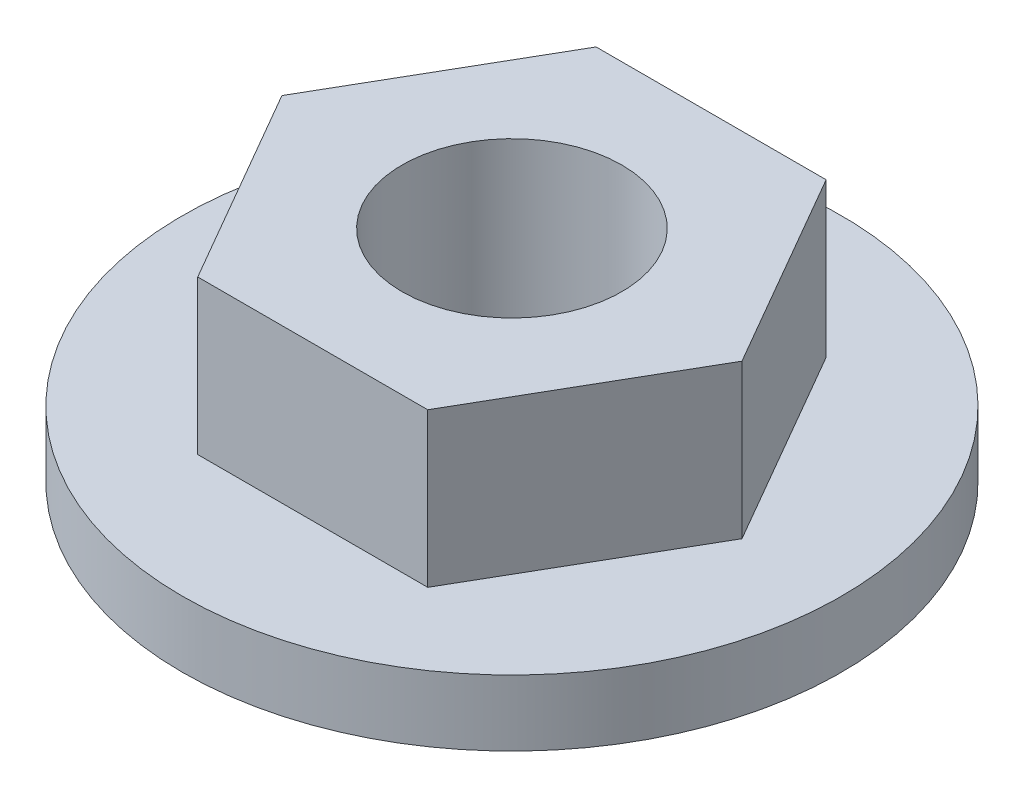
ISO-10303-21;
HEADER;
FILE_DESCRIPTION(('STEP AP214'),'2;1');
FILE_NAME('part.step','',(''),(''),'','','');
FILE_SCHEMA(('AUTOMOTIVE_DESIGN { 1 0 10303 214 1 1 1 1 }'));
ENDSEC;
DATA;
#1=APPLICATION_CONTEXT('core data for automotive mechanical design processes');
#2=APPLICATION_PROTOCOL_DEFINITION('international standard','automotive_design',2000,#1);
#3=PRODUCT_CONTEXT('',#1,'mechanical');
#4=PRODUCT('Part','Part','',(#3));
#5=PRODUCT_RELATED_PRODUCT_CATEGORY('part','',(#4));
#6=PRODUCT_DEFINITION_FORMATION('','',#4);
#7=PRODUCT_DEFINITION_CONTEXT('part definition',#1,'design');
#8=PRODUCT_DEFINITION('design','',#6,#7);
#9=PRODUCT_DEFINITION_SHAPE('','',#8);
#10=(LENGTH_UNIT() NAMED_UNIT(*) SI_UNIT(.MILLI.,.METRE.));
#11=(NAMED_UNIT(*) PLANE_ANGLE_UNIT() SI_UNIT($,.RADIAN.));
#12=(NAMED_UNIT(*) SI_UNIT($,.STERADIAN.) SOLID_ANGLE_UNIT());
#13=UNCERTAINTY_MEASURE_WITH_UNIT(LENGTH_MEASURE(1.E-05),#10,'distance_accuracy_value','');
#14=(GEOMETRIC_REPRESENTATION_CONTEXT(3) GLOBAL_UNCERTAINTY_ASSIGNED_CONTEXT((#13)) GLOBAL_UNIT_ASSIGNED_CONTEXT((#10,
#11,#12)) REPRESENTATION_CONTEXT('',''));
#15=CARTESIAN_POINT('',(0.,0.,0.));
#16=DIRECTION('',(0.,0.,1.));
#17=DIRECTION('',(1.,0.,0.));
#18=AXIS2_PLACEMENT_3D('',#15,#16,#17);
#19=CARTESIAN_POINT('',(0.,1.905,0.));
#20=DIRECTION('',(0.,1.,0.));
#21=DIRECTION('',(0.,0.,1.));
#22=AXIS2_PLACEMENT_3D('',#19,#20,#21);
#23=PLANE('',#22);
#24=CARTESIAN_POINT('',(0.,1.905,0.));
#25=DIRECTION('',(0.,1.,0.));
#26=DIRECTION('',(0.,0.,1.));
#27=AXIS2_PLACEMENT_3D('',#24,#25,#26);
#28=CIRCLE('',#27,9.525);
#29=CARTESIAN_POINT('',(0.,1.905,9.525));
#30=VERTEX_POINT('',#29);
#31=EDGE_CURVE('E11',#30,#30,#28,.T.);
#32=ORIENTED_EDGE('',*,*,#31,.T.);
#33=EDGE_LOOP('',(#32));
#34=FACE_BOUND('',#33,.T.);
#35=DIRECTION('',(-0.500000000000001,0.,-0.866025403784438));
#36=VECTOR('',#35,1.);
#37=CARTESIAN_POINT('',(6.6476476589529,1.905,0.));
#38=LINE('',#37,#36);
#39=CARTESIAN_POINT('',(6.6476476589529,1.905,0.));
#40=VERTEX_POINT('',#39);
#41=CARTESIAN_POINT('',(3.32382382947644,1.905,-5.75703174806137));
#42=VERTEX_POINT('',#41);
#43=EDGE_CURVE('E137',#40,#42,#38,.T.);
#44=ORIENTED_EDGE('',*,*,#43,.F.);
#45=DIRECTION('',(0.499999999999995,0.,-0.866025403784441));
#46=VECTOR('',#45,1.);
#47=CARTESIAN_POINT('',(3.32382382947652,1.905,5.75703174806132));
#48=LINE('',#47,#46);
#49=CARTESIAN_POINT('',(3.32382382947652,1.905,5.75703174806132));
#50=VERTEX_POINT('',#49);
#51=EDGE_CURVE('E133',#50,#40,#48,.T.);
#52=ORIENTED_EDGE('',*,*,#51,.F.);
#53=DIRECTION('',(1.,0.,0.));
#54=VECTOR('',#53,1.);
#55=CARTESIAN_POINT('',(-3.3238238294764,1.905,5.75703174806139));
#56=LINE('',#55,#54);
#57=CARTESIAN_POINT('',(-3.3238238294764,1.905,5.75703174806139));
#58=VERTEX_POINT('',#57);
#59=EDGE_CURVE('E87',#58,#50,#56,.T.);
#60=ORIENTED_EDGE('',*,*,#59,.F.);
#61=DIRECTION('',(0.500000000000007,0.,0.866025403784434));
#62=VECTOR('',#61,1.);
#63=CARTESIAN_POINT('',(-6.6476476589529,1.905,0.));
#64=LINE('',#63,#62);
#65=CARTESIAN_POINT('',(-6.6476476589529,1.905,0.));
#66=VERTEX_POINT('',#65);
#67=EDGE_CURVE('E146',#66,#58,#64,.T.);
#68=ORIENTED_EDGE('',*,*,#67,.F.);
#69=DIRECTION('',(-0.499999999999995,0.,0.866025403784441));
#70=VECTOR('',#69,1.);
#71=CARTESIAN_POINT('',(-3.32382382947648,1.905,-5.75703174806135));
#72=LINE('',#71,#70);
#73=CARTESIAN_POINT('',(-3.32382382947648,1.905,-5.75703174806135));
#74=VERTEX_POINT('',#73);
#75=EDGE_CURVE('E119',#74,#66,#72,.T.);
#76=ORIENTED_EDGE('',*,*,#75,.F.);
#77=DIRECTION('',(-1.,0.,0.));
#78=VECTOR('',#77,1.);
#79=CARTESIAN_POINT('',(3.32382382947644,1.905,-5.75703174806137));
#80=LINE('',#79,#78);
#81=EDGE_CURVE('E141',#42,#74,#80,.T.);
#82=ORIENTED_EDGE('',*,*,#81,.F.);
#83=EDGE_LOOP('',(#44,#52,#60,#68,#76,#82));
#84=FACE_BOUND('',#83,.T.);
#85=ADVANCED_FACE('F43',(#34,#84),#23,.T.);
#86=CARTESIAN_POINT('',(0.,0.,0.));
#87=DIRECTION('',(0.,1.,0.));
#88=DIRECTION('',(0.,0.,1.));
#89=AXIS2_PLACEMENT_3D('',#86,#87,#88);
#90=PLANE('',#89);
#91=CARTESIAN_POINT('',(0.,0.,0.));
#92=DIRECTION('',(0.,1.,0.));
#93=DIRECTION('',(0.,0.,1.));
#94=AXIS2_PLACEMENT_3D('',#91,#92,#93);
#95=CIRCLE('',#94,9.525);
#96=CARTESIAN_POINT('',(0.,0.,9.525));
#97=VERTEX_POINT('',#96);
#98=EDGE_CURVE('E47',#97,#97,#95,.T.);
#99=ORIENTED_EDGE('',*,*,#98,.F.);
#100=EDGE_LOOP('',(#99));
#101=FACE_BOUND('',#100,.T.);
#102=CARTESIAN_POINT('',(0.,0.,0.));
#103=DIRECTION('',(0.,1.,0.));
#104=DIRECTION('',(0.,0.,1.));
#105=AXIS2_PLACEMENT_3D('',#102,#103,#104);
#106=CIRCLE('',#105,3.175);
#107=CARTESIAN_POINT('',(0.,0.,3.175));
#108=VERTEX_POINT('',#107);
#109=EDGE_CURVE('E165',#108,#108,#106,.T.);
#110=ORIENTED_EDGE('',*,*,#109,.T.);
#111=EDGE_LOOP('',(#110));
#112=FACE_BOUND('',#111,.T.);
#113=ADVANCED_FACE('F175',(#101,#112),#90,.F.);
#114=CARTESIAN_POINT('',(0.,1.905,0.));
#115=DIRECTION('',(0.,-1.,0.));
#116=DIRECTION('',(0.,0.,-1.));
#117=AXIS2_PLACEMENT_3D('',#114,#115,#116);
#118=CYLINDRICAL_SURFACE('',#117,9.525);
#119=ORIENTED_EDGE('',*,*,#31,.F.);
#120=EDGE_LOOP('',(#119));
#121=FACE_BOUND('',#120,.T.);
#122=ORIENTED_EDGE('',*,*,#98,.T.);
#123=EDGE_LOOP('',(#122));
#124=FACE_BOUND('',#123,.T.);
#125=ADVANCED_FACE('F45',(#121,#124),#118,.T.);
#126=CARTESIAN_POINT('',(0.,1.905,0.));
#127=DIRECTION('',(0.,-1.,0.));
#128=DIRECTION('',(0.,0.,-1.));
#129=AXIS2_PLACEMENT_3D('',#126,#127,#128);
#130=CYLINDRICAL_SURFACE('',#129,3.175);
#131=ORIENTED_EDGE('',*,*,#109,.F.);
#132=EDGE_LOOP('',(#131));
#133=FACE_BOUND('',#132,.T.);
#134=CARTESIAN_POINT('',(0.,6.35,0.));
#135=DIRECTION('',(0.,1.,0.));
#136=DIRECTION('',(0.,0.,1.));
#137=AXIS2_PLACEMENT_3D('',#134,#135,#136);
#138=CIRCLE('',#137,3.175);
#139=CARTESIAN_POINT('',(0.,6.35,3.175));
#140=VERTEX_POINT('',#139);
#141=EDGE_CURVE('E138',#140,#140,#138,.T.);
#142=ORIENTED_EDGE('',*,*,#141,.T.);
#143=EDGE_LOOP('',(#142));
#144=FACE_BOUND('',#143,.T.);
#145=ADVANCED_FACE('F181',(#133,#144),#130,.F.);
#146=CARTESIAN_POINT('',(0.,6.35,0.));
#147=DIRECTION('',(0.,1.,0.));
#148=DIRECTION('',(0.,0.,1.));
#149=AXIS2_PLACEMENT_3D('',#146,#147,#148);
#150=PLANE('',#149);
#151=DIRECTION('',(0.499999999999995,0.,-0.866025403784441));
#152=VECTOR('',#151,1.);
#153=CARTESIAN_POINT('',(3.32382382947652,6.35,5.75703174806132));
#154=LINE('',#153,#152);
#155=CARTESIAN_POINT('',(3.32382382947652,6.35,5.75703174806132));
#156=VERTEX_POINT('',#155);
#157=CARTESIAN_POINT('',(6.6476476589529,6.35,0.));
#158=VERTEX_POINT('',#157);
#159=EDGE_CURVE('E151',#156,#158,#154,.T.);
#160=ORIENTED_EDGE('',*,*,#159,.T.);
#161=DIRECTION('',(-0.500000000000001,0.,-0.866025403784438));
#162=VECTOR('',#161,1.);
#163=CARTESIAN_POINT('',(6.6476476589529,6.35,0.));
#164=LINE('',#163,#162);
#165=CARTESIAN_POINT('',(3.32382382947644,6.35,-5.75703174806137));
#166=VERTEX_POINT('',#165);
#167=EDGE_CURVE('E95',#158,#166,#164,.T.);
#168=ORIENTED_EDGE('',*,*,#167,.T.);
#169=DIRECTION('',(-1.,0.,0.));
#170=VECTOR('',#169,1.);
#171=CARTESIAN_POINT('',(3.32382382947644,6.35,-5.75703174806137));
#172=LINE('',#171,#170);
#173=CARTESIAN_POINT('',(-3.32382382947648,6.35,-5.75703174806135));
#174=VERTEX_POINT('',#173);
#175=EDGE_CURVE('E109',#166,#174,#172,.T.);
#176=ORIENTED_EDGE('',*,*,#175,.T.);
#177=DIRECTION('',(-0.499999999999995,0.,0.866025403784441));
#178=VECTOR('',#177,1.);
#179=CARTESIAN_POINT('',(-3.32382382947648,6.35,-5.75703174806135));
#180=LINE('',#179,#178);
#181=CARTESIAN_POINT('',(-6.6476476589529,6.35,0.));
#182=VERTEX_POINT('',#181);
#183=EDGE_CURVE('E102',#174,#182,#180,.T.);
#184=ORIENTED_EDGE('',*,*,#183,.T.);
#185=DIRECTION('',(0.500000000000007,0.,0.866025403784434));
#186=VECTOR('',#185,1.);
#187=CARTESIAN_POINT('',(-6.6476476589529,6.35,0.));
#188=LINE('',#187,#186);
#189=CARTESIAN_POINT('',(-3.3238238294764,6.35,5.75703174806139));
#190=VERTEX_POINT('',#189);
#191=EDGE_CURVE('E107',#182,#190,#188,.T.);
#192=ORIENTED_EDGE('',*,*,#191,.T.);
#193=DIRECTION('',(1.,0.,0.));
#194=VECTOR('',#193,1.);
#195=CARTESIAN_POINT('',(-3.3238238294764,6.35,5.75703174806139));
#196=LINE('',#195,#194);
#197=EDGE_CURVE('E67',#190,#156,#196,.T.);
#198=ORIENTED_EDGE('',*,*,#197,.T.);
#199=EDGE_LOOP('',(#160,#168,#176,#184,#192,#198));
#200=FACE_BOUND('',#199,.T.);
#201=ORIENTED_EDGE('',*,*,#141,.F.);
#202=EDGE_LOOP('',(#201));
#203=FACE_BOUND('',#202,.T.);
#204=ADVANCED_FACE('F104',(#200,#203),#150,.T.);
#205=CARTESIAN_POINT('',(3.32382382947652,6.35,5.75703174806132));
#206=DIRECTION('',(-0.866025403784441,0.,-0.499999999999995));
#207=DIRECTION('',(-0.499999999999995,0.,0.866025403784442));
#208=AXIS2_PLACEMENT_3D('',#205,#206,#207);
#209=PLANE('',#208);
#210=ORIENTED_EDGE('',*,*,#51,.T.);
#211=DIRECTION('',(0.,-1.,0.));
#212=VECTOR('',#211,1.);
#213=CARTESIAN_POINT('',(6.6476476589529,6.35,0.));
#214=LINE('',#213,#212);
#215=EDGE_CURVE('E162',#158,#40,#214,.T.);
#216=ORIENTED_EDGE('',*,*,#215,.F.);
#217=ORIENTED_EDGE('',*,*,#159,.F.);
#218=DIRECTION('',(0.,-1.,0.));
#219=VECTOR('',#218,1.);
#220=CARTESIAN_POINT('',(3.32382382947652,6.35,5.75703174806132));
#221=LINE('',#220,#219);
#222=EDGE_CURVE('E129',#156,#50,#221,.T.);
#223=ORIENTED_EDGE('',*,*,#222,.T.);
#224=EDGE_LOOP('',(#210,#216,#217,#223));
#225=FACE_BOUND('',#224,.T.);
#226=ADVANCED_FACE('F189',(#225),#209,.F.);
#227=CARTESIAN_POINT('',(6.6476476589529,6.35,0.));
#228=DIRECTION('',(-0.866025403784438,0.,0.500000000000001));
#229=DIRECTION('',(0.500000000000001,0.,0.866025403784438));
#230=AXIS2_PLACEMENT_3D('',#227,#228,#229);
#231=PLANE('',#230);
#232=ORIENTED_EDGE('',*,*,#43,.T.);
#233=DIRECTION('',(0.,-1.,0.));
#234=VECTOR('',#233,1.);
#235=CARTESIAN_POINT('',(3.32382382947644,6.35,-5.75703174806137));
#236=LINE('',#235,#234);
#237=EDGE_CURVE('E158',#166,#42,#236,.T.);
#238=ORIENTED_EDGE('',*,*,#237,.F.);
#239=ORIENTED_EDGE('',*,*,#167,.F.);
#240=ORIENTED_EDGE('',*,*,#215,.T.);
#241=EDGE_LOOP('',(#232,#238,#239,#240));
#242=FACE_BOUND('',#241,.T.);
#243=ADVANCED_FACE('F192',(#242),#231,.F.);
#244=CARTESIAN_POINT('',(3.32382382947644,6.35,-5.75703174806137));
#245=DIRECTION('',(0.,0.,1.));
#246=DIRECTION('',(1.,0.,0.));
#247=AXIS2_PLACEMENT_3D('',#244,#245,#246);
#248=PLANE('',#247);
#249=ORIENTED_EDGE('',*,*,#81,.T.);
#250=DIRECTION('',(0.,-1.,0.));
#251=VECTOR('',#250,1.);
#252=CARTESIAN_POINT('',(-3.32382382947648,6.35,-5.75703174806135));
#253=LINE('',#252,#251);
#254=EDGE_CURVE('E123',#174,#74,#253,.T.);
#255=ORIENTED_EDGE('',*,*,#254,.F.);
#256=ORIENTED_EDGE('',*,*,#175,.F.);
#257=ORIENTED_EDGE('',*,*,#237,.T.);
#258=EDGE_LOOP('',(#249,#255,#256,#257));
#259=FACE_BOUND('',#258,.T.);
#260=ADVANCED_FACE('F196',(#259),#248,.F.);
#261=CARTESIAN_POINT('',(-3.32382382947648,6.35,-5.75703174806135));
#262=DIRECTION('',(0.866025403784441,0.,0.499999999999995));
#263=DIRECTION('',(0.499999999999995,0.,-0.866025403784442));
#264=AXIS2_PLACEMENT_3D('',#261,#262,#263);
#265=PLANE('',#264);
#266=ORIENTED_EDGE('',*,*,#75,.T.);
#267=DIRECTION('',(0.,-1.,0.));
#268=VECTOR('',#267,1.);
#269=CARTESIAN_POINT('',(-6.6476476589529,6.35,0.));
#270=LINE('',#269,#268);
#271=EDGE_CURVE('E116',#182,#66,#270,.T.);
#272=ORIENTED_EDGE('',*,*,#271,.F.);
#273=ORIENTED_EDGE('',*,*,#183,.F.);
#274=ORIENTED_EDGE('',*,*,#254,.T.);
#275=EDGE_LOOP('',(#266,#272,#273,#274));
#276=FACE_BOUND('',#275,.T.);
#277=ADVANCED_FACE('F117',(#276),#265,.F.);
#278=CARTESIAN_POINT('',(-6.6476476589529,6.35,0.));
#279=DIRECTION('',(0.866025403784434,0.,-0.500000000000007));
#280=DIRECTION('',(-0.500000000000007,0.,-0.866025403784435));
#281=AXIS2_PLACEMENT_3D('',#278,#279,#280);
#282=PLANE('',#281);
#283=ORIENTED_EDGE('',*,*,#67,.T.);
#284=DIRECTION('',(0.,-1.,0.));
#285=VECTOR('',#284,1.);
#286=CARTESIAN_POINT('',(-3.3238238294764,6.35,5.75703174806139));
#287=LINE('',#286,#285);
#288=EDGE_CURVE('E59',#190,#58,#287,.T.);
#289=ORIENTED_EDGE('',*,*,#288,.F.);
#290=ORIENTED_EDGE('',*,*,#191,.F.);
#291=ORIENTED_EDGE('',*,*,#271,.T.);
#292=EDGE_LOOP('',(#283,#289,#290,#291));
#293=FACE_BOUND('',#292,.T.);
#294=ADVANCED_FACE('F125',(#293),#282,.F.);
#295=CARTESIAN_POINT('',(-3.3238238294764,6.35,5.75703174806139));
#296=DIRECTION('',(0.,0.,-1.));
#297=DIRECTION('',(-1.,0.,0.));
#298=AXIS2_PLACEMENT_3D('',#295,#296,#297);
#299=PLANE('',#298);
#300=ORIENTED_EDGE('',*,*,#59,.T.);
#301=ORIENTED_EDGE('',*,*,#222,.F.);
#302=ORIENTED_EDGE('',*,*,#197,.F.);
#303=ORIENTED_EDGE('',*,*,#288,.T.);
#304=EDGE_LOOP('',(#300,#301,#302,#303));
#305=FACE_BOUND('',#304,.T.);
#306=ADVANCED_FACE('F204',(#305),#299,.F.);
#307=CLOSED_SHELL('',(#85,#113,#125,#145,#204,#226,#243,#260,#277,#294,#306));
#308=MANIFOLD_SOLID_BREP('B2',#307);
#309=ADVANCED_BREP_SHAPE_REPRESENTATION('',(#18,#308),#14);
#310=SHAPE_DEFINITION_REPRESENTATION(#9,#309);
ENDSEC;
END-ISO-10303-21;
